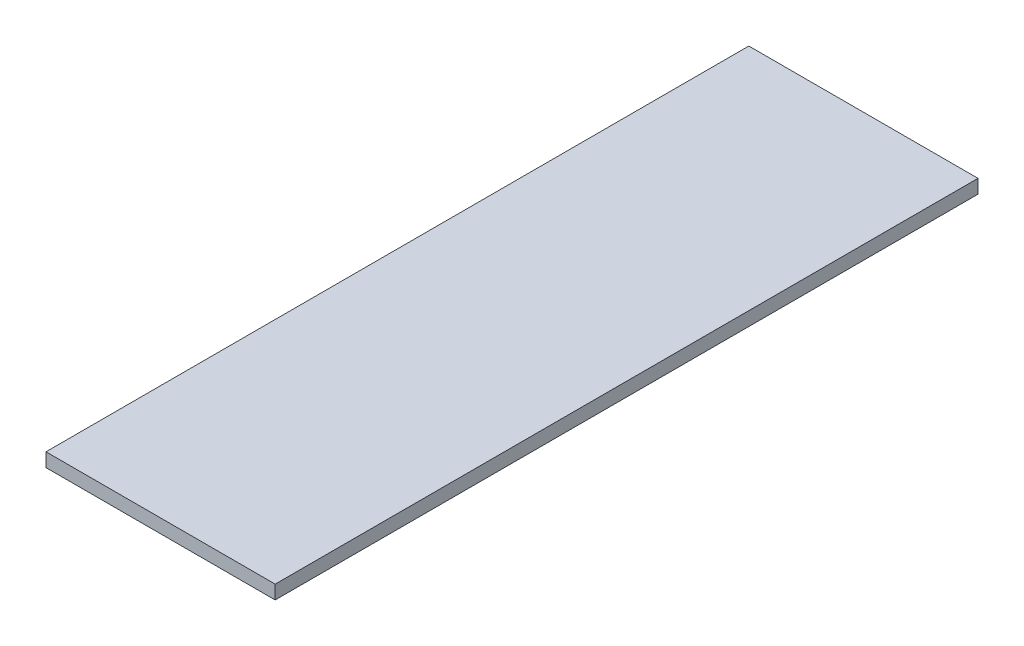
ISO-10303-21;
HEADER;
FILE_DESCRIPTION(('STEP AP214'),'2;1');
FILE_NAME('part.step','',(''),(''),'','','');
FILE_SCHEMA(('AUTOMOTIVE_DESIGN { 1 0 10303 214 1 1 1 1 }'));
ENDSEC;
DATA;
#1=APPLICATION_CONTEXT('core data for automotive mechanical design processes');
#2=APPLICATION_PROTOCOL_DEFINITION('international standard','automotive_design',2000,#1);
#3=PRODUCT_CONTEXT('',#1,'mechanical');
#4=PRODUCT('Part','Part','',(#3));
#5=PRODUCT_RELATED_PRODUCT_CATEGORY('part','',(#4));
#6=PRODUCT_DEFINITION_FORMATION('','',#4);
#7=PRODUCT_DEFINITION_CONTEXT('part definition',#1,'design');
#8=PRODUCT_DEFINITION('design','',#6,#7);
#9=PRODUCT_DEFINITION_SHAPE('','',#8);
#10=(LENGTH_UNIT() NAMED_UNIT(*) SI_UNIT(.MILLI.,.METRE.));
#11=(NAMED_UNIT(*) PLANE_ANGLE_UNIT() SI_UNIT($,.RADIAN.));
#12=(NAMED_UNIT(*) SI_UNIT($,.STERADIAN.) SOLID_ANGLE_UNIT());
#13=UNCERTAINTY_MEASURE_WITH_UNIT(LENGTH_MEASURE(1.E-05),#10,'distance_accuracy_value','');
#14=(GEOMETRIC_REPRESENTATION_CONTEXT(3) GLOBAL_UNCERTAINTY_ASSIGNED_CONTEXT((#13)) GLOBAL_UNIT_ASSIGNED_CONTEXT((#10,
#11,#12)) REPRESENTATION_CONTEXT('',''));
#15=CARTESIAN_POINT('',(0.,0.,0.));
#16=DIRECTION('',(0.,0.,1.));
#17=DIRECTION('',(1.,0.,0.));
#18=AXIS2_PLACEMENT_3D('',#15,#16,#17);
#19=CARTESIAN_POINT('',(-150.,18.,460.));
#20=DIRECTION('',(1.,0.,0.));
#21=DIRECTION('',(0.,0.,-1.));
#22=AXIS2_PLACEMENT_3D('',#19,#20,#21);
#23=PLANE('',#22);
#24=DIRECTION('',(0.,0.,1.));
#25=VECTOR('',#24,1.);
#26=CARTESIAN_POINT('',(-150.,0.,460.));
#27=LINE('',#26,#25);
#28=CARTESIAN_POINT('',(-150.,0.,-460.));
#29=VERTEX_POINT('',#28);
#30=CARTESIAN_POINT('',(-150.,0.,460.));
#31=VERTEX_POINT('',#30);
#32=EDGE_CURVE('E98',#29,#31,#27,.T.);
#33=ORIENTED_EDGE('',*,*,#32,.T.);
#34=DIRECTION('',(0.,-1.,0.));
#35=VECTOR('',#34,1.);
#36=CARTESIAN_POINT('',(-150.,18.,460.));
#37=LINE('',#36,#35);
#38=CARTESIAN_POINT('',(-150.,18.,460.));
#39=VERTEX_POINT('',#38);
#40=EDGE_CURVE('E11',#39,#31,#37,.T.);
#41=ORIENTED_EDGE('',*,*,#40,.F.);
#42=DIRECTION('',(0.,0.,1.));
#43=VECTOR('',#42,1.);
#44=CARTESIAN_POINT('',(-150.,18.,460.));
#45=LINE('',#44,#43);
#46=CARTESIAN_POINT('',(-150.,18.,-460.));
#47=VERTEX_POINT('',#46);
#48=EDGE_CURVE('E86',#47,#39,#45,.T.);
#49=ORIENTED_EDGE('',*,*,#48,.F.);
#50=DIRECTION('',(0.,-1.,0.));
#51=VECTOR('',#50,1.);
#52=CARTESIAN_POINT('',(-150.,18.,-460.));
#53=LINE('',#52,#51);
#54=EDGE_CURVE('E94',#47,#29,#53,.T.);
#55=ORIENTED_EDGE('',*,*,#54,.T.);
#56=EDGE_LOOP('',(#33,#41,#49,#55));
#57=FACE_BOUND('',#56,.T.);
#58=ADVANCED_FACE('F35',(#57),#23,.F.);
#59=CARTESIAN_POINT('',(150.,18.,460.));
#60=DIRECTION('',(0.,0.,-1.));
#61=DIRECTION('',(-1.,0.,0.));
#62=AXIS2_PLACEMENT_3D('',#59,#60,#61);
#63=PLANE('',#62);
#64=DIRECTION('',(1.,0.,0.));
#65=VECTOR('',#64,1.);
#66=CARTESIAN_POINT('',(150.,0.,460.));
#67=LINE('',#66,#65);
#68=CARTESIAN_POINT('',(150.,0.,460.));
#69=VERTEX_POINT('',#68);
#70=EDGE_CURVE('E90',#31,#69,#67,.T.);
#71=ORIENTED_EDGE('',*,*,#70,.T.);
#72=DIRECTION('',(0.,-1.,0.));
#73=VECTOR('',#72,1.);
#74=CARTESIAN_POINT('',(150.,18.,460.));
#75=LINE('',#74,#73);
#76=CARTESIAN_POINT('',(150.,18.,460.));
#77=VERTEX_POINT('',#76);
#78=EDGE_CURVE('E43',#77,#69,#75,.T.);
#79=ORIENTED_EDGE('',*,*,#78,.F.);
#80=DIRECTION('',(1.,0.,0.));
#81=VECTOR('',#80,1.);
#82=CARTESIAN_POINT('',(150.,18.,460.));
#83=LINE('',#82,#81);
#84=EDGE_CURVE('E81',#39,#77,#83,.T.);
#85=ORIENTED_EDGE('',*,*,#84,.F.);
#86=ORIENTED_EDGE('',*,*,#40,.T.);
#87=EDGE_LOOP('',(#71,#79,#85,#86));
#88=FACE_BOUND('',#87,.T.);
#89=ADVANCED_FACE('F89',(#88),#63,.F.);
#90=CARTESIAN_POINT('',(150.,18.,460.));
#91=DIRECTION('',(-1.,0.,0.));
#92=DIRECTION('',(0.,0.,1.));
#93=AXIS2_PLACEMENT_3D('',#90,#91,#92);
#94=PLANE('',#93);
#95=DIRECTION('',(0.,0.,-1.));
#96=VECTOR('',#95,1.);
#97=CARTESIAN_POINT('',(150.,0.,460.));
#98=LINE('',#97,#96);
#99=CARTESIAN_POINT('',(150.,0.,-460.));
#100=VERTEX_POINT('',#99);
#101=EDGE_CURVE('E68',#69,#100,#98,.T.);
#102=ORIENTED_EDGE('',*,*,#101,.T.);
#103=DIRECTION('',(0.,-1.,0.));
#104=VECTOR('',#103,1.);
#105=CARTESIAN_POINT('',(150.,18.,-460.));
#106=LINE('',#105,#104);
#107=CARTESIAN_POINT('',(150.,18.,-460.));
#108=VERTEX_POINT('',#107);
#109=EDGE_CURVE('E91',#108,#100,#106,.T.);
#110=ORIENTED_EDGE('',*,*,#109,.F.);
#111=DIRECTION('',(0.,0.,-1.));
#112=VECTOR('',#111,1.);
#113=CARTESIAN_POINT('',(150.,18.,460.));
#114=LINE('',#113,#112);
#115=EDGE_CURVE('E84',#77,#108,#114,.T.);
#116=ORIENTED_EDGE('',*,*,#115,.F.);
#117=ORIENTED_EDGE('',*,*,#78,.T.);
#118=EDGE_LOOP('',(#102,#110,#116,#117));
#119=FACE_BOUND('',#118,.T.);
#120=ADVANCED_FACE('F92',(#119),#94,.F.);
#121=CARTESIAN_POINT('',(150.,18.,-460.));
#122=DIRECTION('',(0.,0.,1.));
#123=DIRECTION('',(1.,0.,0.));
#124=AXIS2_PLACEMENT_3D('',#121,#122,#123);
#125=PLANE('',#124);
#126=DIRECTION('',(-1.,0.,0.));
#127=VECTOR('',#126,1.);
#128=CARTESIAN_POINT('',(150.,0.,-460.));
#129=LINE('',#128,#127);
#130=EDGE_CURVE('E74',#100,#29,#129,.T.);
#131=ORIENTED_EDGE('',*,*,#130,.T.);
#132=ORIENTED_EDGE('',*,*,#54,.F.);
#133=DIRECTION('',(-1.,0.,0.));
#134=VECTOR('',#133,1.);
#135=CARTESIAN_POINT('',(150.,18.,-460.));
#136=LINE('',#135,#134);
#137=EDGE_CURVE('E51',#108,#47,#136,.T.);
#138=ORIENTED_EDGE('',*,*,#137,.F.);
#139=ORIENTED_EDGE('',*,*,#109,.T.);
#140=EDGE_LOOP('',(#131,#132,#138,#139));
#141=FACE_BOUND('',#140,.T.);
#142=ADVANCED_FACE('F105',(#141),#125,.F.);
#143=CARTESIAN_POINT('',(0.,18.,0.));
#144=DIRECTION('',(0.,1.,0.));
#145=DIRECTION('',(0.,0.,1.));
#146=AXIS2_PLACEMENT_3D('',#143,#144,#145);
#147=PLANE('',#146);
#148=ORIENTED_EDGE('',*,*,#48,.T.);
#149=ORIENTED_EDGE('',*,*,#84,.T.);
#150=ORIENTED_EDGE('',*,*,#115,.T.);
#151=ORIENTED_EDGE('',*,*,#137,.T.);
#152=EDGE_LOOP('',(#148,#149,#150,#151));
#153=FACE_BOUND('',#152,.T.);
#154=ADVANCED_FACE('F82',(#153),#147,.T.);
#155=CARTESIAN_POINT('',(0.,0.,0.));
#156=DIRECTION('',(0.,1.,0.));
#157=DIRECTION('',(0.,0.,1.));
#158=AXIS2_PLACEMENT_3D('',#155,#156,#157);
#159=PLANE('',#158);
#160=ORIENTED_EDGE('',*,*,#32,.F.);
#161=ORIENTED_EDGE('',*,*,#130,.F.);
#162=ORIENTED_EDGE('',*,*,#101,.F.);
#163=ORIENTED_EDGE('',*,*,#70,.F.);
#164=EDGE_LOOP('',(#160,#161,#162,#163));
#165=FACE_BOUND('',#164,.T.);
#166=ADVANCED_FACE('F108',(#165),#159,.F.);
#167=CLOSED_SHELL('',(#58,#89,#120,#142,#154,#166));
#168=MANIFOLD_SOLID_BREP('B2',#167);
#169=ADVANCED_BREP_SHAPE_REPRESENTATION('',(#18,#168),#14);
#170=SHAPE_DEFINITION_REPRESENTATION(#9,#169);
ENDSEC;
END-ISO-10303-21;
